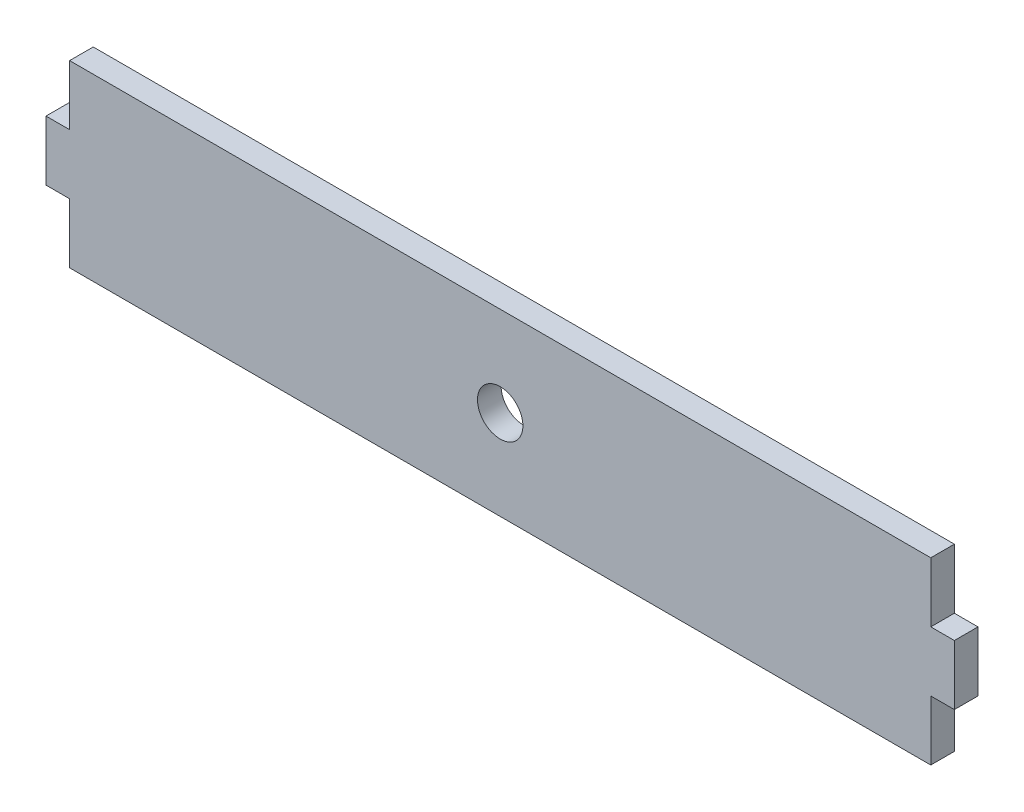
ISO-10303-21;
HEADER;
FILE_DESCRIPTION(('STEP AP214'),'2;1');
FILE_NAME('part.step','',(''),(''),'','','');
FILE_SCHEMA(('AUTOMOTIVE_DESIGN { 1 0 10303 214 1 1 1 1 }'));
ENDSEC;
DATA;
#1=APPLICATION_CONTEXT('core data for automotive mechanical design processes');
#2=APPLICATION_PROTOCOL_DEFINITION('international standard','automotive_design',2000,#1);
#3=PRODUCT_CONTEXT('',#1,'mechanical');
#4=PRODUCT('Part','Part','',(#3));
#5=PRODUCT_RELATED_PRODUCT_CATEGORY('part','',(#4));
#6=PRODUCT_DEFINITION_FORMATION('','',#4);
#7=PRODUCT_DEFINITION_CONTEXT('part definition',#1,'design');
#8=PRODUCT_DEFINITION('design','',#6,#7);
#9=PRODUCT_DEFINITION_SHAPE('','',#8);
#10=(LENGTH_UNIT() NAMED_UNIT(*) SI_UNIT(.MILLI.,.METRE.));
#11=(NAMED_UNIT(*) PLANE_ANGLE_UNIT() SI_UNIT($,.RADIAN.));
#12=(NAMED_UNIT(*) SI_UNIT($,.STERADIAN.) SOLID_ANGLE_UNIT());
#13=UNCERTAINTY_MEASURE_WITH_UNIT(LENGTH_MEASURE(1.E-05),#10,'distance_accuracy_value','');
#14=(GEOMETRIC_REPRESENTATION_CONTEXT(3) GLOBAL_UNCERTAINTY_ASSIGNED_CONTEXT((#13)) GLOBAL_UNIT_ASSIGNED_CONTEXT((#10,
#11,#12)) REPRESENTATION_CONTEXT('',''));
#15=CARTESIAN_POINT('',(0.,0.,0.));
#16=DIRECTION('',(0.,0.,1.));
#17=DIRECTION('',(1.,0.,0.));
#18=AXIS2_PLACEMENT_3D('',#15,#16,#17);
#19=CARTESIAN_POINT('',(2.6,12.0115204964642,2.6));
#20=DIRECTION('',(0.,0.,1.));
#21=DIRECTION('',(1.,0.,0.));
#22=AXIS2_PLACEMENT_3D('',#19,#20,#21);
#23=PLANE('',#22);
#24=DIRECTION('',(0.,-1.,0.));
#25=VECTOR('',#24,1.);
#26=CARTESIAN_POINT('',(2.59999999999999,18.598483349364,2.6));
#27=LINE('',#26,#25);
#28=CARTESIAN_POINT('',(2.59999999999999,18.598483349364,2.6));
#29=VERTEX_POINT('',#28);
#30=CARTESIAN_POINT('',(2.6,12.0115204964642,2.6));
#31=VERTEX_POINT('',#30);
#32=EDGE_CURVE('E174',#29,#31,#27,.T.);
#33=ORIENTED_EDGE('',*,*,#32,.T.);
#34=DIRECTION('',(-1.,0.,0.));
#35=VECTOR('',#34,1.);
#36=CARTESIAN_POINT('',(0.,12.0115204964642,2.6));
#37=LINE('',#36,#35);
#38=CARTESIAN_POINT('',(0.,12.0115204964642,2.6));
#39=VERTEX_POINT('',#38);
#40=EDGE_CURVE('E102',#31,#39,#37,.T.);
#41=ORIENTED_EDGE('',*,*,#40,.T.);
#42=DIRECTION('',(0.,-1.,0.));
#43=VECTOR('',#42,1.);
#44=CARTESIAN_POINT('',(0.,5.4245576435645,2.6));
#45=LINE('',#44,#43);
#46=CARTESIAN_POINT('',(0.,5.4245576435645,2.6));
#47=VERTEX_POINT('',#46);
#48=EDGE_CURVE('E201',#39,#47,#45,.T.);
#49=ORIENTED_EDGE('',*,*,#48,.T.);
#50=DIRECTION('',(1.,0.,0.));
#51=VECTOR('',#50,1.);
#52=CARTESIAN_POINT('',(0.,5.4245576435645,2.6));
#53=LINE('',#52,#51);
#54=CARTESIAN_POINT('',(2.6,5.4245576435645,2.6));
#55=VERTEX_POINT('',#54);
#56=EDGE_CURVE('E220',#47,#55,#53,.T.);
#57=ORIENTED_EDGE('',*,*,#56,.T.);
#58=DIRECTION('',(0.,-1.,0.));
#59=VECTOR('',#58,1.);
#60=CARTESIAN_POINT('',(2.59999999999999,-1.16240520933526,2.6));
#61=LINE('',#60,#59);
#62=CARTESIAN_POINT('',(2.59999999999999,-1.16240520933526,2.6));
#63=VERTEX_POINT('',#62);
#64=EDGE_CURVE('E217',#55,#63,#61,.T.);
#65=ORIENTED_EDGE('',*,*,#64,.T.);
#66=DIRECTION('',(1.,0.,0.));
#67=VECTOR('',#66,1.);
#68=CARTESIAN_POINT('',(2.59999999999999,-1.16240520933526,2.6));
#69=LINE('',#68,#67);
#70=CARTESIAN_POINT('',(97.4,-1.16240520933527,2.6));
#71=VERTEX_POINT('',#70);
#72=EDGE_CURVE('E219',#63,#71,#69,.T.);
#73=ORIENTED_EDGE('',*,*,#72,.T.);
#74=DIRECTION('',(0.,1.,0.));
#75=VECTOR('',#74,1.);
#76=CARTESIAN_POINT('',(97.4,-1.16240520933527,2.6));
#77=LINE('',#76,#75);
#78=CARTESIAN_POINT('',(97.4,5.42455764356449,2.6));
#79=VERTEX_POINT('',#78);
#80=EDGE_CURVE('E222',#71,#79,#77,.T.);
#81=ORIENTED_EDGE('',*,*,#80,.T.);
#82=DIRECTION('',(1.,0.,0.));
#83=VECTOR('',#82,1.);
#84=CARTESIAN_POINT('',(100.,5.4245576435645,2.6));
#85=LINE('',#84,#83);
#86=CARTESIAN_POINT('',(100.,5.4245576435645,2.6));
#87=VERTEX_POINT('',#86);
#88=EDGE_CURVE('E228',#79,#87,#85,.T.);
#89=ORIENTED_EDGE('',*,*,#88,.T.);
#90=DIRECTION('',(0.,1.,0.));
#91=VECTOR('',#90,1.);
#92=CARTESIAN_POINT('',(100.,5.4245576435645,2.6));
#93=LINE('',#92,#91);
#94=CARTESIAN_POINT('',(100.,12.0115204964642,2.6));
#95=VERTEX_POINT('',#94);
#96=EDGE_CURVE('E133',#87,#95,#93,.T.);
#97=ORIENTED_EDGE('',*,*,#96,.T.);
#98=DIRECTION('',(-1.,0.,0.));
#99=VECTOR('',#98,1.);
#100=CARTESIAN_POINT('',(100.,12.0115204964642,2.6));
#101=LINE('',#100,#99);
#102=CARTESIAN_POINT('',(97.4,12.0115204964643,2.6));
#103=VERTEX_POINT('',#102);
#104=EDGE_CURVE('E127',#95,#103,#101,.T.);
#105=ORIENTED_EDGE('',*,*,#104,.T.);
#106=DIRECTION('',(0.,1.,0.));
#107=VECTOR('',#106,1.);
#108=CARTESIAN_POINT('',(97.4,18.598483349364,2.6));
#109=LINE('',#108,#107);
#110=CARTESIAN_POINT('',(97.4,18.598483349364,2.6));
#111=VERTEX_POINT('',#110);
#112=EDGE_CURVE('E131',#103,#111,#109,.T.);
#113=ORIENTED_EDGE('',*,*,#112,.T.);
#114=DIRECTION('',(-1.,0.,0.));
#115=VECTOR('',#114,1.);
#116=CARTESIAN_POINT('',(2.59999999999999,18.598483349364,2.6));
#117=LINE('',#116,#115);
#118=EDGE_CURVE('E47',#111,#29,#117,.T.);
#119=ORIENTED_EDGE('',*,*,#118,.T.);
#120=EDGE_LOOP('',(#33,#41,#49,#57,#65,#73,#81,#89,#97,#105,#113,#119));
#121=FACE_BOUND('',#120,.T.);
#122=CARTESIAN_POINT('',(50.,8.71803907001437,2.6));
#123=DIRECTION('',(0.,0.,1.));
#124=DIRECTION('',(1.,0.,0.));
#125=AXIS2_PLACEMENT_3D('',#122,#123,#124);
#126=CIRCLE('',#125,2.5);
#127=CARTESIAN_POINT('',(52.5,8.71803907001437,2.6));
#128=VERTEX_POINT('',#127);
#129=EDGE_CURVE('E155',#128,#128,#126,.T.);
#130=ORIENTED_EDGE('',*,*,#129,.F.);
#131=EDGE_LOOP('',(#130));
#132=FACE_BOUND('',#131,.T.);
#133=ADVANCED_FACE('F30',(#121,#132),#23,.T.);
#134=CARTESIAN_POINT('',(2.6,12.0115204964642,0.));
#135=DIRECTION('',(0.,0.,1.));
#136=DIRECTION('',(1.,0.,0.));
#137=AXIS2_PLACEMENT_3D('',#134,#135,#136);
#138=PLANE('',#137);
#139=DIRECTION('',(0.,-1.,0.));
#140=VECTOR('',#139,1.);
#141=CARTESIAN_POINT('',(2.59999999999999,18.598483349364,0.));
#142=LINE('',#141,#140);
#143=CARTESIAN_POINT('',(2.59999999999999,18.598483349364,0.));
#144=VERTEX_POINT('',#143);
#145=CARTESIAN_POINT('',(2.6,12.0115204964642,0.));
#146=VERTEX_POINT('',#145);
#147=EDGE_CURVE('E151',#144,#146,#142,.T.);
#148=ORIENTED_EDGE('',*,*,#147,.F.);
#149=DIRECTION('',(-1.,0.,0.));
#150=VECTOR('',#149,1.);
#151=CARTESIAN_POINT('',(2.59999999999999,18.598483349364,0.));
#152=LINE('',#151,#150);
#153=CARTESIAN_POINT('',(97.4,18.598483349364,0.));
#154=VERTEX_POINT('',#153);
#155=EDGE_CURVE('E94',#154,#144,#152,.T.);
#156=ORIENTED_EDGE('',*,*,#155,.F.);
#157=DIRECTION('',(0.,1.,0.));
#158=VECTOR('',#157,1.);
#159=CARTESIAN_POINT('',(97.4,18.598483349364,0.));
#160=LINE('',#159,#158);
#161=CARTESIAN_POINT('',(97.4,12.0115204964643,0.));
#162=VERTEX_POINT('',#161);
#163=EDGE_CURVE('E88',#162,#154,#160,.T.);
#164=ORIENTED_EDGE('',*,*,#163,.F.);
#165=DIRECTION('',(-1.,0.,0.));
#166=VECTOR('',#165,1.);
#167=CARTESIAN_POINT('',(100.,12.0115204964642,0.));
#168=LINE('',#167,#166);
#169=CARTESIAN_POINT('',(100.,12.0115204964642,0.));
#170=VERTEX_POINT('',#169);
#171=EDGE_CURVE('E141',#170,#162,#168,.T.);
#172=ORIENTED_EDGE('',*,*,#171,.F.);
#173=DIRECTION('',(0.,1.,0.));
#174=VECTOR('',#173,1.);
#175=CARTESIAN_POINT('',(100.,5.4245576435645,0.));
#176=LINE('',#175,#174);
#177=CARTESIAN_POINT('',(100.,5.4245576435645,0.));
#178=VERTEX_POINT('',#177);
#179=EDGE_CURVE('E169',#178,#170,#176,.T.);
#180=ORIENTED_EDGE('',*,*,#179,.F.);
#181=DIRECTION('',(1.,0.,0.));
#182=VECTOR('',#181,1.);
#183=CARTESIAN_POINT('',(100.,5.4245576435645,0.));
#184=LINE('',#183,#182);
#185=CARTESIAN_POINT('',(97.4,5.42455764356449,0.));
#186=VERTEX_POINT('',#185);
#187=EDGE_CURVE('E167',#186,#178,#184,.T.);
#188=ORIENTED_EDGE('',*,*,#187,.F.);
#189=DIRECTION('',(0.,1.,0.));
#190=VECTOR('',#189,1.);
#191=CARTESIAN_POINT('',(97.4,-1.16240520933527,0.));
#192=LINE('',#191,#190);
#193=CARTESIAN_POINT('',(97.4,-1.16240520933527,0.));
#194=VERTEX_POINT('',#193);
#195=EDGE_CURVE('E165',#194,#186,#192,.T.);
#196=ORIENTED_EDGE('',*,*,#195,.F.);
#197=DIRECTION('',(1.,0.,0.));
#198=VECTOR('',#197,1.);
#199=CARTESIAN_POINT('',(2.59999999999999,-1.16240520933526,0.));
#200=LINE('',#199,#198);
#201=CARTESIAN_POINT('',(2.59999999999999,-1.16240520933526,0.));
#202=VERTEX_POINT('',#201);
#203=EDGE_CURVE('E163',#202,#194,#200,.T.);
#204=ORIENTED_EDGE('',*,*,#203,.F.);
#205=DIRECTION('',(0.,-1.,0.));
#206=VECTOR('',#205,1.);
#207=CARTESIAN_POINT('',(2.59999999999999,-1.16240520933526,0.));
#208=LINE('',#207,#206);
#209=CARTESIAN_POINT('',(2.6,5.4245576435645,0.));
#210=VERTEX_POINT('',#209);
#211=EDGE_CURVE('E161',#210,#202,#208,.T.);
#212=ORIENTED_EDGE('',*,*,#211,.F.);
#213=DIRECTION('',(1.,0.,0.));
#214=VECTOR('',#213,1.);
#215=CARTESIAN_POINT('',(0.,5.4245576435645,0.));
#216=LINE('',#215,#214);
#217=CARTESIAN_POINT('',(0.,5.4245576435645,0.));
#218=VERTEX_POINT('',#217);
#219=EDGE_CURVE('E159',#218,#210,#216,.T.);
#220=ORIENTED_EDGE('',*,*,#219,.F.);
#221=DIRECTION('',(0.,-1.,0.));
#222=VECTOR('',#221,1.);
#223=CARTESIAN_POINT('',(0.,5.4245576435645,0.));
#224=LINE('',#223,#222);
#225=CARTESIAN_POINT('',(0.,12.0115204964642,0.));
#226=VERTEX_POINT('',#225);
#227=EDGE_CURVE('E157',#226,#218,#224,.T.);
#228=ORIENTED_EDGE('',*,*,#227,.F.);
#229=DIRECTION('',(-1.,0.,0.));
#230=VECTOR('',#229,1.);
#231=CARTESIAN_POINT('',(0.,12.0115204964642,0.));
#232=LINE('',#231,#230);
#233=EDGE_CURVE('E154',#146,#226,#232,.T.);
#234=ORIENTED_EDGE('',*,*,#233,.F.);
#235=EDGE_LOOP('',(#148,#156,#164,#172,#180,#188,#196,#204,#212,#220,#228,#234));
#236=FACE_BOUND('',#235,.T.);
#237=CARTESIAN_POINT('',(50.,8.71803907001437,0.));
#238=DIRECTION('',(0.,0.,1.));
#239=DIRECTION('',(1.,0.,0.));
#240=AXIS2_PLACEMENT_3D('',#237,#238,#239);
#241=CIRCLE('',#240,2.5);
#242=CARTESIAN_POINT('',(52.5,8.71803907001437,0.));
#243=VERTEX_POINT('',#242);
#244=EDGE_CURVE('E375',#243,#243,#241,.T.);
#245=ORIENTED_EDGE('',*,*,#244,.T.);
#246=EDGE_LOOP('',(#245));
#247=FACE_BOUND('',#246,.T.);
#248=ADVANCED_FACE('F205',(#236,#247),#138,.F.);
#249=CARTESIAN_POINT('',(2.59999999999999,18.598483349364,2.6));
#250=DIRECTION('',(1.,0.,0.));
#251=DIRECTION('',(0.,1.,0.));
#252=AXIS2_PLACEMENT_3D('',#249,#250,#251);
#253=PLANE('',#252);
#254=ORIENTED_EDGE('',*,*,#147,.T.);
#255=DIRECTION('',(0.,0.,-1.));
#256=VECTOR('',#255,1.);
#257=CARTESIAN_POINT('',(2.6,12.0115204964642,2.6));
#258=LINE('',#257,#256);
#259=EDGE_CURVE('E11',#31,#146,#258,.T.);
#260=ORIENTED_EDGE('',*,*,#259,.F.);
#261=ORIENTED_EDGE('',*,*,#32,.F.);
#262=DIRECTION('',(0.,0.,-1.));
#263=VECTOR('',#262,1.);
#264=CARTESIAN_POINT('',(2.59999999999999,18.598483349364,2.6));
#265=LINE('',#264,#263);
#266=EDGE_CURVE('E147',#29,#144,#265,.T.);
#267=ORIENTED_EDGE('',*,*,#266,.T.);
#268=EDGE_LOOP('',(#254,#260,#261,#267));
#269=FACE_BOUND('',#268,.T.);
#270=ADVANCED_FACE('F32',(#269),#253,.F.);
#271=CARTESIAN_POINT('',(0.,12.0115204964642,2.6));
#272=DIRECTION('',(0.,-1.,0.));
#273=DIRECTION('',(0.,0.,-1.));
#274=AXIS2_PLACEMENT_3D('',#271,#272,#273);
#275=PLANE('',#274);
#276=ORIENTED_EDGE('',*,*,#233,.T.);
#277=DIRECTION('',(0.,0.,-1.));
#278=VECTOR('',#277,1.);
#279=CARTESIAN_POINT('',(0.,12.0115204964642,2.6));
#280=LINE('',#279,#278);
#281=EDGE_CURVE('E39',#39,#226,#280,.T.);
#282=ORIENTED_EDGE('',*,*,#281,.F.);
#283=ORIENTED_EDGE('',*,*,#40,.F.);
#284=ORIENTED_EDGE('',*,*,#259,.T.);
#285=EDGE_LOOP('',(#276,#282,#283,#284));
#286=FACE_BOUND('',#285,.T.);
#287=ADVANCED_FACE('F262',(#286),#275,.F.);
#288=CARTESIAN_POINT('',(0.,5.4245576435645,2.6));
#289=DIRECTION('',(1.,0.,0.));
#290=DIRECTION('',(0.,0.,-1.));
#291=AXIS2_PLACEMENT_3D('',#288,#289,#290);
#292=PLANE('',#291);
#293=ORIENTED_EDGE('',*,*,#227,.T.);
#294=DIRECTION('',(0.,0.,-1.));
#295=VECTOR('',#294,1.);
#296=CARTESIAN_POINT('',(0.,5.4245576435645,2.6));
#297=LINE('',#296,#295);
#298=EDGE_CURVE('E193',#47,#218,#297,.T.);
#299=ORIENTED_EDGE('',*,*,#298,.F.);
#300=ORIENTED_EDGE('',*,*,#48,.F.);
#301=ORIENTED_EDGE('',*,*,#281,.T.);
#302=EDGE_LOOP('',(#293,#299,#300,#301));
#303=FACE_BOUND('',#302,.T.);
#304=ADVANCED_FACE('F199',(#303),#292,.F.);
#305=CARTESIAN_POINT('',(0.,5.4245576435645,2.6));
#306=DIRECTION('',(0.,1.,0.));
#307=DIRECTION('',(0.,0.,1.));
#308=AXIS2_PLACEMENT_3D('',#305,#306,#307);
#309=PLANE('',#308);
#310=ORIENTED_EDGE('',*,*,#219,.T.);
#311=DIRECTION('',(0.,0.,-1.));
#312=VECTOR('',#311,1.);
#313=CARTESIAN_POINT('',(2.6,5.4245576435645,2.6));
#314=LINE('',#313,#312);
#315=EDGE_CURVE('E190',#55,#210,#314,.T.);
#316=ORIENTED_EDGE('',*,*,#315,.F.);
#317=ORIENTED_EDGE('',*,*,#56,.F.);
#318=ORIENTED_EDGE('',*,*,#298,.T.);
#319=EDGE_LOOP('',(#310,#316,#317,#318));
#320=FACE_BOUND('',#319,.T.);
#321=ADVANCED_FACE('F211',(#320),#309,.F.);
#322=CARTESIAN_POINT('',(2.59999999999999,-1.16240520933526,2.6));
#323=DIRECTION('',(1.,0.,0.));
#324=DIRECTION('',(0.,1.,0.));
#325=AXIS2_PLACEMENT_3D('',#322,#323,#324);
#326=PLANE('',#325);
#327=ORIENTED_EDGE('',*,*,#211,.T.);
#328=DIRECTION('',(0.,0.,-1.));
#329=VECTOR('',#328,1.);
#330=CARTESIAN_POINT('',(2.59999999999999,-1.16240520933526,2.6));
#331=LINE('',#330,#329);
#332=EDGE_CURVE('E187',#63,#202,#331,.T.);
#333=ORIENTED_EDGE('',*,*,#332,.F.);
#334=ORIENTED_EDGE('',*,*,#64,.F.);
#335=ORIENTED_EDGE('',*,*,#315,.T.);
#336=EDGE_LOOP('',(#327,#333,#334,#335));
#337=FACE_BOUND('',#336,.T.);
#338=ADVANCED_FACE('F215',(#337),#326,.F.);
#339=CARTESIAN_POINT('',(2.59999999999999,-1.16240520933526,2.6));
#340=DIRECTION('',(0.,1.,0.));
#341=DIRECTION('',(-1.,0.,0.));
#342=AXIS2_PLACEMENT_3D('',#339,#340,#341);
#343=PLANE('',#342);
#344=ORIENTED_EDGE('',*,*,#203,.T.);
#345=DIRECTION('',(0.,0.,-1.));
#346=VECTOR('',#345,1.);
#347=CARTESIAN_POINT('',(97.4,-1.16240520933527,2.6));
#348=LINE('',#347,#346);
#349=EDGE_CURVE('E184',#71,#194,#348,.T.);
#350=ORIENTED_EDGE('',*,*,#349,.F.);
#351=ORIENTED_EDGE('',*,*,#72,.F.);
#352=ORIENTED_EDGE('',*,*,#332,.T.);
#353=EDGE_LOOP('',(#344,#350,#351,#352));
#354=FACE_BOUND('',#353,.T.);
#355=ADVANCED_FACE('F275',(#354),#343,.F.);
#356=CARTESIAN_POINT('',(97.4,-1.16240520933527,2.6));
#357=DIRECTION('',(-1.,0.,0.));
#358=DIRECTION('',(0.,-1.,0.));
#359=AXIS2_PLACEMENT_3D('',#356,#357,#358);
#360=PLANE('',#359);
#361=ORIENTED_EDGE('',*,*,#195,.T.);
#362=DIRECTION('',(0.,0.,-1.));
#363=VECTOR('',#362,1.);
#364=CARTESIAN_POINT('',(97.4,5.42455764356449,2.6));
#365=LINE('',#364,#363);
#366=EDGE_CURVE('E181',#79,#186,#365,.T.);
#367=ORIENTED_EDGE('',*,*,#366,.F.);
#368=ORIENTED_EDGE('',*,*,#80,.F.);
#369=ORIENTED_EDGE('',*,*,#349,.T.);
#370=EDGE_LOOP('',(#361,#367,#368,#369));
#371=FACE_BOUND('',#370,.T.);
#372=ADVANCED_FACE('F278',(#371),#360,.F.);
#373=CARTESIAN_POINT('',(100.,5.4245576435645,2.6));
#374=DIRECTION('',(0.,1.,0.));
#375=DIRECTION('',(-1.,0.,0.));
#376=AXIS2_PLACEMENT_3D('',#373,#374,#375);
#377=PLANE('',#376);
#378=ORIENTED_EDGE('',*,*,#187,.T.);
#379=DIRECTION('',(0.,0.,-1.));
#380=VECTOR('',#379,1.);
#381=CARTESIAN_POINT('',(100.,5.4245576435645,2.6));
#382=LINE('',#381,#380);
#383=EDGE_CURVE('E178',#87,#178,#382,.T.);
#384=ORIENTED_EDGE('',*,*,#383,.F.);
#385=ORIENTED_EDGE('',*,*,#88,.F.);
#386=ORIENTED_EDGE('',*,*,#366,.T.);
#387=EDGE_LOOP('',(#378,#384,#385,#386));
#388=FACE_BOUND('',#387,.T.);
#389=ADVANCED_FACE('F234',(#388),#377,.F.);
#390=CARTESIAN_POINT('',(100.,5.4245576435645,2.6));
#391=DIRECTION('',(-1.,0.,0.));
#392=DIRECTION('',(0.,0.,1.));
#393=AXIS2_PLACEMENT_3D('',#390,#391,#392);
#394=PLANE('',#393);
#395=ORIENTED_EDGE('',*,*,#179,.T.);
#396=DIRECTION('',(0.,0.,-1.));
#397=VECTOR('',#396,1.);
#398=CARTESIAN_POINT('',(100.,12.0115204964642,2.6));
#399=LINE('',#398,#397);
#400=EDGE_CURVE('E142',#95,#170,#399,.T.);
#401=ORIENTED_EDGE('',*,*,#400,.F.);
#402=ORIENTED_EDGE('',*,*,#96,.F.);
#403=ORIENTED_EDGE('',*,*,#383,.T.);
#404=EDGE_LOOP('',(#395,#401,#402,#403));
#405=FACE_BOUND('',#404,.T.);
#406=ADVANCED_FACE('F238',(#405),#394,.F.);
#407=CARTESIAN_POINT('',(100.,12.0115204964642,2.6));
#408=DIRECTION('',(0.,-1.,0.));
#409=DIRECTION('',(1.,0.,0.));
#410=AXIS2_PLACEMENT_3D('',#407,#408,#409);
#411=PLANE('',#410);
#412=ORIENTED_EDGE('',*,*,#171,.T.);
#413=DIRECTION('',(0.,0.,-1.));
#414=VECTOR('',#413,1.);
#415=CARTESIAN_POINT('',(97.4,12.0115204964643,2.6));
#416=LINE('',#415,#414);
#417=EDGE_CURVE('E138',#103,#162,#416,.T.);
#418=ORIENTED_EDGE('',*,*,#417,.F.);
#419=ORIENTED_EDGE('',*,*,#104,.F.);
#420=ORIENTED_EDGE('',*,*,#400,.T.);
#421=EDGE_LOOP('',(#412,#418,#419,#420));
#422=FACE_BOUND('',#421,.T.);
#423=ADVANCED_FACE('F139',(#422),#411,.F.);
#424=CARTESIAN_POINT('',(97.4,18.598483349364,2.6));
#425=DIRECTION('',(-1.,0.,0.));
#426=DIRECTION('',(0.,-1.,0.));
#427=AXIS2_PLACEMENT_3D('',#424,#425,#426);
#428=PLANE('',#427);
#429=ORIENTED_EDGE('',*,*,#163,.T.);
#430=DIRECTION('',(0.,0.,-1.));
#431=VECTOR('',#430,1.);
#432=CARTESIAN_POINT('',(97.4,18.598483349364,2.6));
#433=LINE('',#432,#431);
#434=EDGE_CURVE('E143',#111,#154,#433,.T.);
#435=ORIENTED_EDGE('',*,*,#434,.F.);
#436=ORIENTED_EDGE('',*,*,#112,.F.);
#437=ORIENTED_EDGE('',*,*,#417,.T.);
#438=EDGE_LOOP('',(#429,#435,#436,#437));
#439=FACE_BOUND('',#438,.T.);
#440=ADVANCED_FACE('F145',(#439),#428,.F.);
#441=CARTESIAN_POINT('',(2.59999999999999,18.598483349364,2.6));
#442=DIRECTION('',(0.,-1.,0.));
#443=DIRECTION('',(1.,0.,0.));
#444=AXIS2_PLACEMENT_3D('',#441,#442,#443);
#445=PLANE('',#444);
#446=ORIENTED_EDGE('',*,*,#155,.T.);
#447=ORIENTED_EDGE('',*,*,#266,.F.);
#448=ORIENTED_EDGE('',*,*,#118,.F.);
#449=ORIENTED_EDGE('',*,*,#434,.T.);
#450=EDGE_LOOP('',(#446,#447,#448,#449));
#451=FACE_BOUND('',#450,.T.);
#452=ADVANCED_FACE('F242',(#451),#445,.F.);
#453=CARTESIAN_POINT('',(50.,8.71803907001437,2.6));
#454=DIRECTION('',(0.,0.,-1.));
#455=DIRECTION('',(-1.,0.,0.));
#456=AXIS2_PLACEMENT_3D('',#453,#454,#455);
#457=CYLINDRICAL_SURFACE('',#456,2.5);
#458=ORIENTED_EDGE('',*,*,#129,.T.);
#459=EDGE_LOOP('',(#458));
#460=FACE_BOUND('',#459,.T.);
#461=ORIENTED_EDGE('',*,*,#244,.F.);
#462=EDGE_LOOP('',(#461));
#463=FACE_BOUND('',#462,.T.);
#464=ADVANCED_FACE('F244',(#460,#463),#457,.F.);
#465=CLOSED_SHELL('',(#133,#248,#270,#287,#304,#321,#338,#355,#372,#389,#406,#423,#440,#452,#464));
#466=MANIFOLD_SOLID_BREP('B2',#465);
#467=ADVANCED_BREP_SHAPE_REPRESENTATION('',(#18,#466),#14);
#468=SHAPE_DEFINITION_REPRESENTATION(#9,#467);
ENDSEC;
END-ISO-10303-21;
